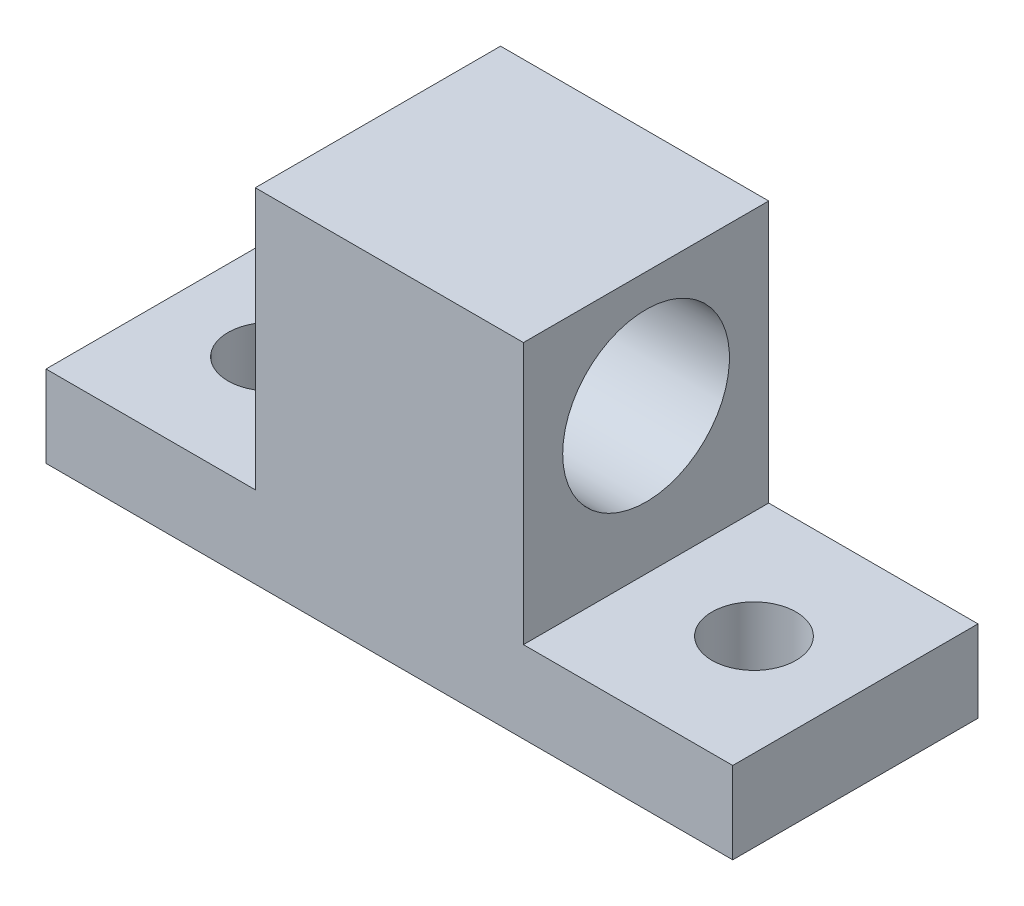
ISO-10303-21;
HEADER;
FILE_DESCRIPTION(('STEP AP214'),'2;1');
FILE_NAME('part.step','',(''),(''),'','','');
FILE_SCHEMA(('AUTOMOTIVE_DESIGN { 1 0 10303 214 1 1 1 1 }'));
ENDSEC;
DATA;
#1=APPLICATION_CONTEXT('core data for automotive mechanical design processes');
#2=APPLICATION_PROTOCOL_DEFINITION('international standard','automotive_design',2000,#1);
#3=PRODUCT_CONTEXT('',#1,'mechanical');
#4=PRODUCT('Part','Part','',(#3));
#5=PRODUCT_RELATED_PRODUCT_CATEGORY('part','',(#4));
#6=PRODUCT_DEFINITION_FORMATION('','',#4);
#7=PRODUCT_DEFINITION_CONTEXT('part definition',#1,'design');
#8=PRODUCT_DEFINITION('design','',#6,#7);
#9=PRODUCT_DEFINITION_SHAPE('','',#8);
#10=(LENGTH_UNIT() NAMED_UNIT(*) SI_UNIT(.MILLI.,.METRE.));
#11=(NAMED_UNIT(*) PLANE_ANGLE_UNIT() SI_UNIT($,.RADIAN.));
#12=(NAMED_UNIT(*) SI_UNIT($,.STERADIAN.) SOLID_ANGLE_UNIT());
#13=UNCERTAINTY_MEASURE_WITH_UNIT(LENGTH_MEASURE(1.E-05),#10,'distance_accuracy_value','');
#14=(GEOMETRIC_REPRESENTATION_CONTEXT(3) GLOBAL_UNCERTAINTY_ASSIGNED_CONTEXT((#13)) GLOBAL_UNIT_ASSIGNED_CONTEXT((#10,
#11,#12)) REPRESENTATION_CONTEXT('',''));
#15=CARTESIAN_POINT('',(0.,0.,0.));
#16=DIRECTION('',(0.,0.,1.));
#17=DIRECTION('',(1.,0.,0.));
#18=AXIS2_PLACEMENT_3D('',#15,#16,#17);
#19=CARTESIAN_POINT('',(0.,6.35,0.));
#20=DIRECTION('',(0.,1.,0.));
#21=DIRECTION('',(0.,0.,1.));
#22=AXIS2_PLACEMENT_3D('',#19,#20,#21);
#23=PLANE('',#22);
#24=DIRECTION('',(0.,0.,1.));
#25=VECTOR('',#24,1.);
#26=CARTESIAN_POINT('',(-19.1250455281497,6.35,15.9360907544145));
#27=LINE('',#26,#25);
#28=CARTESIAN_POINT('',(-19.1250455281497,6.35,-3.11390924558546));
#29=VERTEX_POINT('',#28);
#30=CARTESIAN_POINT('',(-19.1250455281497,6.35,15.9360907544145));
#31=VERTEX_POINT('',#30);
#32=EDGE_CURVE('E52',#29,#31,#27,.T.);
#33=ORIENTED_EDGE('',*,*,#32,.F.);
#34=DIRECTION('',(1.,0.,0.));
#35=VECTOR('',#34,1.);
#36=CARTESIAN_POINT('',(0.,6.35,-3.11390924558546));
#37=LINE('',#36,#35);
#38=CARTESIAN_POINT('',(-35.3810455281497,6.35,-3.11390924558546));
#39=VERTEX_POINT('',#38);
#40=EDGE_CURVE('E206',#39,#29,#37,.T.);
#41=ORIENTED_EDGE('',*,*,#40,.F.);
#42=DIRECTION('',(0.,0.,1.));
#43=VECTOR('',#42,1.);
#44=CARTESIAN_POINT('',(-35.3810455281497,6.35,0.));
#45=LINE('',#44,#43);
#46=CARTESIAN_POINT('',(-35.3810455281497,6.35,15.9360907544145));
#47=VERTEX_POINT('',#46);
#48=EDGE_CURVE('E201',#39,#47,#45,.T.);
#49=ORIENTED_EDGE('',*,*,#48,.T.);
#50=DIRECTION('',(1.,0.,0.));
#51=VECTOR('',#50,1.);
#52=CARTESIAN_POINT('',(0.,6.35,15.9360907544145));
#53=LINE('',#52,#51);
#54=EDGE_CURVE('E223',#47,#31,#53,.T.);
#55=ORIENTED_EDGE('',*,*,#54,.T.);
#56=EDGE_LOOP('',(#33,#41,#49,#55));
#57=FACE_BOUND('',#56,.T.);
#58=CARTESIAN_POINT('',(-27.5070455281497,6.35,6.41109075441454));
#59=DIRECTION('',(0.,1.,0.));
#60=DIRECTION('',(0.,0.,1.));
#61=AXIS2_PLACEMENT_3D('',#58,#59,#60);
#62=CIRCLE('',#61,3.2639);
#63=CARTESIAN_POINT('',(-27.5070455281497,6.35,9.67499075441455));
#64=VERTEX_POINT('',#63);
#65=EDGE_CURVE('E146',#64,#64,#62,.T.);
#66=ORIENTED_EDGE('',*,*,#65,.F.);
#67=EDGE_LOOP('',(#66));
#68=FACE_BOUND('',#67,.T.);
#69=ADVANCED_FACE('F35',(#57,#68),#23,.T.);
#70=CARTESIAN_POINT('',(0.,6.35,15.9360907544145));
#71=DIRECTION('',(0.,0.,-1.));
#72=DIRECTION('',(-1.,0.,0.));
#73=AXIS2_PLACEMENT_3D('',#70,#71,#72);
#74=PLANE('',#73);
#75=DIRECTION('',(1.,0.,0.));
#76=VECTOR('',#75,1.);
#77=CARTESIAN_POINT('',(0.,0.,15.9360907544145));
#78=LINE('',#77,#76);
#79=CARTESIAN_POINT('',(-35.3810455281497,0.,15.9360907544145));
#80=VERTEX_POINT('',#79);
#81=CARTESIAN_POINT('',(17.9589544718503,0.,15.9360907544145));
#82=VERTEX_POINT('',#81);
#83=EDGE_CURVE('E128',#80,#82,#78,.T.);
#84=ORIENTED_EDGE('',*,*,#83,.T.);
#85=DIRECTION('',(0.,-1.,0.));
#86=VECTOR('',#85,1.);
#87=CARTESIAN_POINT('',(17.9589544718503,6.35,15.9360907544145));
#88=LINE('',#87,#86);
#89=CARTESIAN_POINT('',(17.9589544718503,6.35,15.9360907544145));
#90=VERTEX_POINT('',#89);
#91=EDGE_CURVE('E11',#90,#82,#88,.T.);
#92=ORIENTED_EDGE('',*,*,#91,.F.);
#93=CARTESIAN_POINT('',(1.70295447185026,6.35,15.9360907544145));
#94=VERTEX_POINT('',#93);
#95=EDGE_CURVE('E226',#94,#90,#53,.T.);
#96=ORIENTED_EDGE('',*,*,#95,.F.);
#97=DIRECTION('',(0.,-1.,0.));
#98=VECTOR('',#97,1.);
#99=CARTESIAN_POINT('',(1.70295447185026,26.67,15.9360907544145));
#100=LINE('',#99,#98);
#101=CARTESIAN_POINT('',(1.70295447185026,26.67,15.9360907544145));
#102=VERTEX_POINT('',#101);
#103=EDGE_CURVE('E110',#102,#94,#100,.T.);
#104=ORIENTED_EDGE('',*,*,#103,.F.);
#105=DIRECTION('',(1.,0.,0.));
#106=VECTOR('',#105,1.);
#107=CARTESIAN_POINT('',(-19.1250455281497,26.67,15.9360907544145));
#108=LINE('',#107,#106);
#109=CARTESIAN_POINT('',(-19.1250455281497,26.67,15.9360907544145));
#110=VERTEX_POINT('',#109);
#111=EDGE_CURVE('E102',#110,#102,#108,.T.);
#112=ORIENTED_EDGE('',*,*,#111,.F.);
#113=DIRECTION('',(0.,-1.,0.));
#114=VECTOR('',#113,1.);
#115=CARTESIAN_POINT('',(-19.1250455281497,26.67,15.9360907544145));
#116=LINE('',#115,#114);
#117=EDGE_CURVE('E108',#110,#31,#116,.T.);
#118=ORIENTED_EDGE('',*,*,#117,.T.);
#119=ORIENTED_EDGE('',*,*,#54,.F.);
#120=DIRECTION('',(0.,-1.,0.));
#121=VECTOR('',#120,1.);
#122=CARTESIAN_POINT('',(-35.3810455281497,6.35,15.9360907544145));
#123=LINE('',#122,#121);
#124=EDGE_CURVE('E200',#47,#80,#123,.T.);
#125=ORIENTED_EDGE('',*,*,#124,.T.);
#126=EDGE_LOOP('',(#84,#92,#96,#104,#112,#118,#119,#125));
#127=FACE_BOUND('',#126,.T.);
#128=ADVANCED_FACE('F105',(#127),#74,.F.);
#129=CARTESIAN_POINT('',(17.9589544718503,6.35,0.));
#130=DIRECTION('',(1.,0.,0.));
#131=DIRECTION('',(0.,0.,-1.));
#132=AXIS2_PLACEMENT_3D('',#129,#130,#131);
#133=PLANE('',#132);
#134=DIRECTION('',(0.,0.,1.));
#135=VECTOR('',#134,1.);
#136=CARTESIAN_POINT('',(17.9589544718503,0.,0.));
#137=LINE('',#136,#135);
#138=CARTESIAN_POINT('',(17.9589544718503,0.,-3.11390924558546));
#139=VERTEX_POINT('',#138);
#140=EDGE_CURVE('E210',#139,#82,#137,.T.);
#141=ORIENTED_EDGE('',*,*,#140,.F.);
#142=DIRECTION('',(0.,-1.,0.));
#143=VECTOR('',#142,1.);
#144=CARTESIAN_POINT('',(17.9589544718503,6.35,-3.11390924558546));
#145=LINE('',#144,#143);
#146=CARTESIAN_POINT('',(17.9589544718503,6.35,-3.11390924558546));
#147=VERTEX_POINT('',#146);
#148=EDGE_CURVE('E44',#147,#139,#145,.T.);
#149=ORIENTED_EDGE('',*,*,#148,.F.);
#150=DIRECTION('',(0.,0.,1.));
#151=VECTOR('',#150,1.);
#152=CARTESIAN_POINT('',(17.9589544718503,6.35,0.));
#153=LINE('',#152,#151);
#154=EDGE_CURVE('E225',#147,#90,#153,.T.);
#155=ORIENTED_EDGE('',*,*,#154,.T.);
#156=ORIENTED_EDGE('',*,*,#91,.T.);
#157=EDGE_LOOP('',(#141,#149,#155,#156));
#158=FACE_BOUND('',#157,.T.);
#159=ADVANCED_FACE('F187',(#158),#133,.T.);
#160=CARTESIAN_POINT('',(0.,6.35,-3.11390924558546));
#161=DIRECTION('',(0.,0.,-1.));
#162=DIRECTION('',(-1.,0.,0.));
#163=AXIS2_PLACEMENT_3D('',#160,#161,#162);
#164=PLANE('',#163);
#165=DIRECTION('',(1.,0.,0.));
#166=VECTOR('',#165,1.);
#167=CARTESIAN_POINT('',(0.,0.,-3.11390924558546));
#168=LINE('',#167,#166);
#169=CARTESIAN_POINT('',(-35.3810455281497,0.,-3.11390924558546));
#170=VERTEX_POINT('',#169);
#171=EDGE_CURVE('E213',#170,#139,#168,.T.);
#172=ORIENTED_EDGE('',*,*,#171,.F.);
#173=DIRECTION('',(0.,-1.,0.));
#174=VECTOR('',#173,1.);
#175=CARTESIAN_POINT('',(-35.3810455281497,6.35,-3.11390924558546));
#176=LINE('',#175,#174);
#177=EDGE_CURVE('E204',#39,#170,#176,.T.);
#178=ORIENTED_EDGE('',*,*,#177,.F.);
#179=ORIENTED_EDGE('',*,*,#40,.T.);
#180=DIRECTION('',(0.,-1.,0.));
#181=VECTOR('',#180,1.);
#182=CARTESIAN_POINT('',(-19.1250455281497,26.67,-3.11390924558546));
#183=LINE('',#182,#181);
#184=CARTESIAN_POINT('',(-19.1250455281497,26.67,-3.11390924558546));
#185=VERTEX_POINT('',#184);
#186=EDGE_CURVE('E139',#185,#29,#183,.T.);
#187=ORIENTED_EDGE('',*,*,#186,.F.);
#188=DIRECTION('',(-1.,0.,0.));
#189=VECTOR('',#188,1.);
#190=CARTESIAN_POINT('',(-19.1250455281497,26.67,-3.11390924558546));
#191=LINE('',#190,#189);
#192=CARTESIAN_POINT('',(1.70295447185026,26.67,-3.11390924558546));
#193=VERTEX_POINT('',#192);
#194=EDGE_CURVE('E119',#193,#185,#191,.T.);
#195=ORIENTED_EDGE('',*,*,#194,.F.);
#196=DIRECTION('',(0.,-1.,0.));
#197=VECTOR('',#196,1.);
#198=CARTESIAN_POINT('',(1.70295447185026,26.67,-3.11390924558546));
#199=LINE('',#198,#197);
#200=CARTESIAN_POINT('',(1.70295447185026,6.35,-3.11390924558546));
#201=VERTEX_POINT('',#200);
#202=EDGE_CURVE('E130',#193,#201,#199,.T.);
#203=ORIENTED_EDGE('',*,*,#202,.T.);
#204=EDGE_CURVE('E151',#201,#147,#37,.T.);
#205=ORIENTED_EDGE('',*,*,#204,.T.);
#206=ORIENTED_EDGE('',*,*,#148,.T.);
#207=EDGE_LOOP('',(#172,#178,#179,#187,#195,#203,#205,#206));
#208=FACE_BOUND('',#207,.T.);
#209=ADVANCED_FACE('F235',(#208),#164,.T.);
#210=CARTESIAN_POINT('',(-35.3810455281497,6.35,0.));
#211=DIRECTION('',(1.,0.,0.));
#212=DIRECTION('',(0.,0.,-1.));
#213=AXIS2_PLACEMENT_3D('',#210,#211,#212);
#214=PLANE('',#213);
#215=DIRECTION('',(0.,0.,1.));
#216=VECTOR('',#215,1.);
#217=CARTESIAN_POINT('',(-35.3810455281497,0.,0.));
#218=LINE('',#217,#216);
#219=EDGE_CURVE('E216',#170,#80,#218,.T.);
#220=ORIENTED_EDGE('',*,*,#219,.T.);
#221=ORIENTED_EDGE('',*,*,#124,.F.);
#222=ORIENTED_EDGE('',*,*,#48,.F.);
#223=ORIENTED_EDGE('',*,*,#177,.T.);
#224=EDGE_LOOP('',(#220,#221,#222,#223));
#225=FACE_BOUND('',#224,.T.);
#226=ADVANCED_FACE('F247',(#225),#214,.F.);
#227=CARTESIAN_POINT('',(-27.5070455281497,6.35,6.41109075441454));
#228=DIRECTION('',(0.,-1.,0.));
#229=DIRECTION('',(0.,0.,-1.));
#230=AXIS2_PLACEMENT_3D('',#227,#228,#229);
#231=CYLINDRICAL_SURFACE('',#230,3.2639);
#232=ORIENTED_EDGE('',*,*,#65,.T.);
#233=EDGE_LOOP('',(#232));
#234=FACE_BOUND('',#233,.T.);
#235=CARTESIAN_POINT('',(-27.5070455281497,0.,6.41109075441454));
#236=DIRECTION('',(0.,1.,0.));
#237=DIRECTION('',(0.,0.,1.));
#238=AXIS2_PLACEMENT_3D('',#235,#236,#237);
#239=CIRCLE('',#238,3.2639);
#240=CARTESIAN_POINT('',(-27.5070455281497,0.,9.67499075441455));
#241=VERTEX_POINT('',#240);
#242=EDGE_CURVE('E125',#241,#241,#239,.T.);
#243=ORIENTED_EDGE('',*,*,#242,.F.);
#244=EDGE_LOOP('',(#243));
#245=FACE_BOUND('',#244,.T.);
#246=ADVANCED_FACE('F37',(#234,#245),#231,.F.);
#247=CARTESIAN_POINT('',(10.0849544718503,6.35,6.41109075441454));
#248=DIRECTION('',(0.,-1.,0.));
#249=DIRECTION('',(0.,0.,-1.));
#250=AXIS2_PLACEMENT_3D('',#247,#248,#249);
#251=CYLINDRICAL_SURFACE('',#250,3.26390000000001);
#252=CARTESIAN_POINT('',(10.0849544718503,6.35,6.41109075441454));
#253=DIRECTION('',(0.,1.,0.));
#254=DIRECTION('',(0.,0.,1.));
#255=AXIS2_PLACEMENT_3D('',#252,#253,#254);
#256=CIRCLE('',#255,3.26390000000001);
#257=CARTESIAN_POINT('',(10.0849544718503,6.35,9.67499075441455));
#258=VERTEX_POINT('',#257);
#259=EDGE_CURVE('E199',#258,#258,#256,.T.);
#260=ORIENTED_EDGE('',*,*,#259,.T.);
#261=EDGE_LOOP('',(#260));
#262=FACE_BOUND('',#261,.T.);
#263=CARTESIAN_POINT('',(10.0849544718503,0.,6.41109075441454));
#264=DIRECTION('',(0.,1.,0.));
#265=DIRECTION('',(0.,0.,1.));
#266=AXIS2_PLACEMENT_3D('',#263,#264,#265);
#267=CIRCLE('',#266,3.26390000000001);
#268=CARTESIAN_POINT('',(10.0849544718503,0.,9.67499075441455));
#269=VERTEX_POINT('',#268);
#270=EDGE_CURVE('E218',#269,#269,#267,.T.);
#271=ORIENTED_EDGE('',*,*,#270,.F.);
#272=EDGE_LOOP('',(#271));
#273=FACE_BOUND('',#272,.T.);
#274=ADVANCED_FACE('F190',(#262,#273),#251,.F.);
#275=DIRECTION('',(0.,0.,-1.));
#276=VECTOR('',#275,1.);
#277=CARTESIAN_POINT('',(1.70295447185026,6.35,15.9360907544145));
#278=LINE('',#277,#276);
#279=EDGE_CURVE('E60',#94,#201,#278,.T.);
#280=ORIENTED_EDGE('',*,*,#279,.F.);
#281=ORIENTED_EDGE('',*,*,#95,.T.);
#282=ORIENTED_EDGE('',*,*,#154,.F.);
#283=ORIENTED_EDGE('',*,*,#204,.F.);
#284=EDGE_LOOP('',(#280,#281,#282,#283));
#285=FACE_BOUND('',#284,.T.);
#286=ORIENTED_EDGE('',*,*,#259,.F.);
#287=EDGE_LOOP('',(#286));
#288=FACE_BOUND('',#287,.T.);
#289=ADVANCED_FACE('F179',(#285,#288),#23,.T.);
#290=CARTESIAN_POINT('',(0.,0.,0.));
#291=DIRECTION('',(0.,1.,0.));
#292=DIRECTION('',(0.,0.,1.));
#293=AXIS2_PLACEMENT_3D('',#290,#291,#292);
#294=PLANE('',#293);
#295=ORIENTED_EDGE('',*,*,#242,.T.);
#296=EDGE_LOOP('',(#295));
#297=FACE_BOUND('',#296,.T.);
#298=ORIENTED_EDGE('',*,*,#83,.F.);
#299=ORIENTED_EDGE('',*,*,#219,.F.);
#300=ORIENTED_EDGE('',*,*,#171,.T.);
#301=ORIENTED_EDGE('',*,*,#140,.T.);
#302=EDGE_LOOP('',(#298,#299,#300,#301));
#303=FACE_BOUND('',#302,.T.);
#304=ORIENTED_EDGE('',*,*,#270,.T.);
#305=EDGE_LOOP('',(#304));
#306=FACE_BOUND('',#305,.T.);
#307=ADVANCED_FACE('F171',(#297,#303,#306),#294,.F.);
#308=CARTESIAN_POINT('',(-19.1250455281497,26.67,15.9360907544145));
#309=DIRECTION('',(1.,0.,0.));
#310=DIRECTION('',(0.,0.,-1.));
#311=AXIS2_PLACEMENT_3D('',#308,#309,#310);
#312=PLANE('',#311);
#313=CARTESIAN_POINT('',(-19.1250455281497,17.656309415166,6.41109075441454));
#314=DIRECTION('',(-1.,0.,0.));
#315=DIRECTION('',(0.,0.,1.));
#316=AXIS2_PLACEMENT_3D('',#313,#314,#315);
#317=CIRCLE('',#316,6.477);
#318=CARTESIAN_POINT('',(-19.1250455281497,17.656309415166,12.8880907544145));
#319=VERTEX_POINT('',#318);
#320=EDGE_CURVE('E162',#319,#319,#317,.T.);
#321=ORIENTED_EDGE('',*,*,#320,.F.);
#322=EDGE_LOOP('',(#321));
#323=FACE_BOUND('',#322,.T.);
#324=ORIENTED_EDGE('',*,*,#32,.T.);
#325=ORIENTED_EDGE('',*,*,#117,.F.);
#326=DIRECTION('',(0.,0.,1.));
#327=VECTOR('',#326,1.);
#328=CARTESIAN_POINT('',(-19.1250455281497,26.67,15.9360907544145));
#329=LINE('',#328,#327);
#330=EDGE_CURVE('E114',#185,#110,#329,.T.);
#331=ORIENTED_EDGE('',*,*,#330,.F.);
#332=ORIENTED_EDGE('',*,*,#186,.T.);
#333=EDGE_LOOP('',(#324,#325,#331,#332));
#334=FACE_BOUND('',#333,.T.);
#335=ADVANCED_FACE('F124',(#323,#334),#312,.F.);
#336=CARTESIAN_POINT('',(1.70295447185026,26.67,15.9360907544145));
#337=DIRECTION('',(-1.,0.,0.));
#338=DIRECTION('',(0.,0.,1.));
#339=AXIS2_PLACEMENT_3D('',#336,#337,#338);
#340=PLANE('',#339);
#341=CARTESIAN_POINT('',(1.70295447185026,17.656309415166,6.41109075441454));
#342=DIRECTION('',(-1.,0.,0.));
#343=DIRECTION('',(0.,0.,1.));
#344=AXIS2_PLACEMENT_3D('',#341,#342,#343);
#345=CIRCLE('',#344,6.477);
#346=CARTESIAN_POINT('',(1.70295447185026,17.656309415166,12.8880907544145));
#347=VERTEX_POINT('',#346);
#348=EDGE_CURVE('E138',#347,#347,#345,.F.);
#349=ORIENTED_EDGE('',*,*,#348,.F.);
#350=EDGE_LOOP('',(#349));
#351=FACE_BOUND('',#350,.T.);
#352=ORIENTED_EDGE('',*,*,#279,.T.);
#353=ORIENTED_EDGE('',*,*,#202,.F.);
#354=DIRECTION('',(0.,0.,-1.));
#355=VECTOR('',#354,1.);
#356=CARTESIAN_POINT('',(1.70295447185026,26.67,15.9360907544145));
#357=LINE('',#356,#355);
#358=EDGE_CURVE('E113',#102,#193,#357,.T.);
#359=ORIENTED_EDGE('',*,*,#358,.F.);
#360=ORIENTED_EDGE('',*,*,#103,.T.);
#361=EDGE_LOOP('',(#352,#353,#359,#360));
#362=FACE_BOUND('',#361,.T.);
#363=ADVANCED_FACE('F170',(#351,#362),#340,.F.);
#364=CARTESIAN_POINT('',(0.,26.67,0.));
#365=DIRECTION('',(0.,-1.,0.));
#366=DIRECTION('',(0.,0.,-1.));
#367=AXIS2_PLACEMENT_3D('',#364,#365,#366);
#368=PLANE('',#367);
#369=ORIENTED_EDGE('',*,*,#330,.T.);
#370=ORIENTED_EDGE('',*,*,#111,.T.);
#371=ORIENTED_EDGE('',*,*,#358,.T.);
#372=ORIENTED_EDGE('',*,*,#194,.T.);
#373=EDGE_LOOP('',(#369,#370,#371,#372));
#374=FACE_BOUND('',#373,.T.);
#375=ADVANCED_FACE('F117',(#374),#368,.F.);
#376=CARTESIAN_POINT('',(17.9599794718503,17.656309415166,6.41109075441454));
#377=DIRECTION('',(-1.,0.,0.));
#378=DIRECTION('',(0.,0.,1.));
#379=AXIS2_PLACEMENT_3D('',#376,#377,#378);
#380=CYLINDRICAL_SURFACE('',#379,6.477);
#381=ORIENTED_EDGE('',*,*,#320,.T.);
#382=EDGE_LOOP('',(#381));
#383=FACE_BOUND('',#382,.T.);
#384=ORIENTED_EDGE('',*,*,#348,.T.);
#385=EDGE_LOOP('',(#384));
#386=FACE_BOUND('',#385,.T.);
#387=ADVANCED_FACE('F166',(#383,#386),#380,.F.);
#388=CLOSED_SHELL('',(#69,#128,#159,#209,#226,#246,#274,#289,#307,#335,#363,#375,#387));
#389=MANIFOLD_SOLID_BREP('B2',#388);
#390=ADVANCED_BREP_SHAPE_REPRESENTATION('',(#18,#389),#14);
#391=SHAPE_DEFINITION_REPRESENTATION(#9,#390);
ENDSEC;
END-ISO-10303-21;
